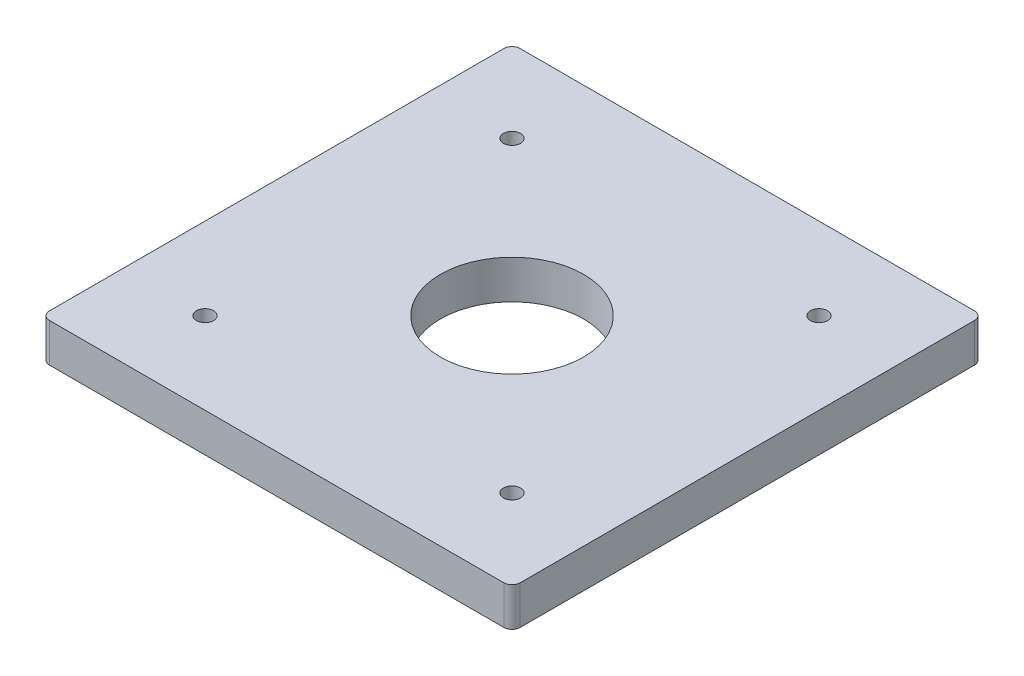
ISO-10303-21;
HEADER;
FILE_DESCRIPTION(('STEP AP214'),'2;1');
FILE_NAME('part.step','',(''),(''),'','','');
FILE_SCHEMA(('AUTOMOTIVE_DESIGN { 1 0 10303 214 1 1 1 1 }'));
ENDSEC;
DATA;
#1=APPLICATION_CONTEXT('core data for automotive mechanical design processes');
#2=APPLICATION_PROTOCOL_DEFINITION('international standard','automotive_design',2000,#1);
#3=PRODUCT_CONTEXT('',#1,'mechanical');
#4=PRODUCT('Part','Part','',(#3));
#5=PRODUCT_RELATED_PRODUCT_CATEGORY('part','',(#4));
#6=PRODUCT_DEFINITION_FORMATION('','',#4);
#7=PRODUCT_DEFINITION_CONTEXT('part definition',#1,'design');
#8=PRODUCT_DEFINITION('design','',#6,#7);
#9=PRODUCT_DEFINITION_SHAPE('','',#8);
#10=(LENGTH_UNIT() NAMED_UNIT(*) SI_UNIT(.MILLI.,.METRE.));
#11=(NAMED_UNIT(*) PLANE_ANGLE_UNIT() SI_UNIT($,.RADIAN.));
#12=(NAMED_UNIT(*) SI_UNIT($,.STERADIAN.) SOLID_ANGLE_UNIT());
#13=UNCERTAINTY_MEASURE_WITH_UNIT(LENGTH_MEASURE(1.E-05),#10,'distance_accuracy_value','');
#14=(GEOMETRIC_REPRESENTATION_CONTEXT(3) GLOBAL_UNCERTAINTY_ASSIGNED_CONTEXT((#13)) GLOBAL_UNIT_ASSIGNED_CONTEXT((#10,
#11,#12)) REPRESENTATION_CONTEXT('',''));
#15=CARTESIAN_POINT('',(0.,0.,0.));
#16=DIRECTION('',(0.,0.,1.));
#17=DIRECTION('',(1.,0.,0.));
#18=AXIS2_PLACEMENT_3D('',#15,#16,#17);
#19=CARTESIAN_POINT('',(0.,0.,0.));
#20=DIRECTION('',(0.,1.,0.));
#21=DIRECTION('',(0.,0.,1.));
#22=AXIS2_PLACEMENT_3D('',#19,#20,#21);
#23=PLANE('',#22);
#24=CARTESIAN_POINT('',(-47.625,0.,47.6249999999999));
#25=DIRECTION('',(0.,1.,0.));
#26=DIRECTION('',(0.,0.,1.));
#27=AXIS2_PLACEMENT_3D('',#24,#25,#26);
#28=CIRCLE('',#27,2.667);
#29=CARTESIAN_POINT('',(-47.625,0.,50.2919999999999));
#30=VERTEX_POINT('',#29);
#31=EDGE_CURVE('E145',#30,#30,#28,.T.);
#32=ORIENTED_EDGE('',*,*,#31,.T.);
#33=EDGE_LOOP('',(#32));
#34=FACE_BOUND('',#33,.T.);
#35=CARTESIAN_POINT('',(47.6249999999999,0.,-47.6250000000001));
#36=DIRECTION('',(0.,1.,0.));
#37=DIRECTION('',(0.,0.,1.));
#38=AXIS2_PLACEMENT_3D('',#35,#36,#37);
#39=CIRCLE('',#38,2.667);
#40=CARTESIAN_POINT('',(47.6249999999999,0.,-44.9580000000001));
#41=VERTEX_POINT('',#40);
#42=EDGE_CURVE('E148',#41,#41,#39,.T.);
#43=ORIENTED_EDGE('',*,*,#42,.T.);
#44=EDGE_LOOP('',(#43));
#45=FACE_BOUND('',#44,.T.);
#46=CARTESIAN_POINT('',(0.,0.,0.));
#47=DIRECTION('',(0.,-1.,0.));
#48=DIRECTION('',(0.,0.,-1.));
#49=AXIS2_PLACEMENT_3D('',#46,#47,#48);
#50=CIRCLE('',#49,22.225);
#51=CARTESIAN_POINT('',(0.,0.,-22.225));
#52=VERTEX_POINT('',#51);
#53=EDGE_CURVE('E151',#52,#52,#50,.F.);
#54=ORIENTED_EDGE('',*,*,#53,.T.);
#55=EDGE_LOOP('',(#54));
#56=FACE_BOUND('',#55,.T.);
#57=CARTESIAN_POINT('',(-70.485,0.,-70.485));
#58=DIRECTION('',(0.,-1.,0.));
#59=DIRECTION('',(0.,0.,-1.));
#60=AXIS2_PLACEMENT_3D('',#57,#58,#59);
#61=CIRCLE('',#60,2.54);
#62=CARTESIAN_POINT('',(-70.485,0.,-73.025));
#63=VERTEX_POINT('',#62);
#64=CARTESIAN_POINT('',(-73.025,0.,-70.485));
#65=VERTEX_POINT('',#64);
#66=EDGE_CURVE('E86',#63,#65,#61,.F.);
#67=ORIENTED_EDGE('',*,*,#66,.F.);
#68=DIRECTION('',(1.,0.,0.));
#69=VECTOR('',#68,1.);
#70=CARTESIAN_POINT('',(73.025,0.,-73.025));
#71=LINE('',#70,#69);
#72=CARTESIAN_POINT('',(70.485,0.,-73.025));
#73=VERTEX_POINT('',#72);
#74=EDGE_CURVE('E78',#63,#73,#71,.T.);
#75=ORIENTED_EDGE('',*,*,#74,.T.);
#76=CARTESIAN_POINT('',(70.485,0.,-70.485));
#77=DIRECTION('',(0.,-1.,0.));
#78=DIRECTION('',(0.,0.,-1.));
#79=AXIS2_PLACEMENT_3D('',#76,#77,#78);
#80=CIRCLE('',#79,2.54);
#81=CARTESIAN_POINT('',(73.025,0.,-70.485));
#82=VERTEX_POINT('',#81);
#83=EDGE_CURVE('E155',#82,#73,#80,.F.);
#84=ORIENTED_EDGE('',*,*,#83,.F.);
#85=DIRECTION('',(0.,0.,1.));
#86=VECTOR('',#85,1.);
#87=CARTESIAN_POINT('',(73.025,0.,73.025));
#88=LINE('',#87,#86);
#89=CARTESIAN_POINT('',(73.025,0.,70.485));
#90=VERTEX_POINT('',#89);
#91=EDGE_CURVE('E113',#82,#90,#88,.T.);
#92=ORIENTED_EDGE('',*,*,#91,.T.);
#93=CARTESIAN_POINT('',(70.485,0.,70.485));
#94=DIRECTION('',(0.,-1.,0.));
#95=DIRECTION('',(0.,0.,-1.));
#96=AXIS2_PLACEMENT_3D('',#93,#94,#95);
#97=CIRCLE('',#96,2.54);
#98=CARTESIAN_POINT('',(70.485,0.,73.025));
#99=VERTEX_POINT('',#98);
#100=EDGE_CURVE('E158',#99,#90,#97,.F.);
#101=ORIENTED_EDGE('',*,*,#100,.F.);
#102=DIRECTION('',(-1.,0.,0.));
#103=VECTOR('',#102,1.);
#104=CARTESIAN_POINT('',(73.025,0.,73.025));
#105=LINE('',#104,#103);
#106=CARTESIAN_POINT('',(-70.485,0.,73.025));
#107=VERTEX_POINT('',#106);
#108=EDGE_CURVE('E117',#99,#107,#105,.T.);
#109=ORIENTED_EDGE('',*,*,#108,.T.);
#110=CARTESIAN_POINT('',(-70.485,0.,70.485));
#111=DIRECTION('',(0.,-1.,0.));
#112=DIRECTION('',(0.,0.,-1.));
#113=AXIS2_PLACEMENT_3D('',#110,#111,#112);
#114=CIRCLE('',#113,2.54);
#115=CARTESIAN_POINT('',(-73.025,0.,70.485));
#116=VERTEX_POINT('',#115);
#117=EDGE_CURVE('E89',#116,#107,#114,.F.);
#118=ORIENTED_EDGE('',*,*,#117,.F.);
#119=DIRECTION('',(0.,0.,-1.));
#120=VECTOR('',#119,1.);
#121=CARTESIAN_POINT('',(-73.025,0.,73.025));
#122=LINE('',#121,#120);
#123=EDGE_CURVE('E83',#116,#65,#122,.T.);
#124=ORIENTED_EDGE('',*,*,#123,.T.);
#125=EDGE_LOOP('',(#67,#75,#84,#92,#101,#109,#118,#124));
#126=FACE_BOUND('',#125,.T.);
#127=CARTESIAN_POINT('',(-47.6250000000001,0.,-47.6250000000001));
#128=DIRECTION('',(0.,1.,0.));
#129=DIRECTION('',(0.,0.,1.));
#130=AXIS2_PLACEMENT_3D('',#127,#128,#129);
#131=CIRCLE('',#130,2.667);
#132=CARTESIAN_POINT('',(-47.6250000000001,0.,-44.9580000000001));
#133=VERTEX_POINT('',#132);
#134=EDGE_CURVE('E112',#133,#133,#131,.T.);
#135=ORIENTED_EDGE('',*,*,#134,.T.);
#136=EDGE_LOOP('',(#135));
#137=FACE_BOUND('',#136,.T.);
#138=CARTESIAN_POINT('',(47.625,0.,47.6249999999999));
#139=DIRECTION('',(0.,1.,0.));
#140=DIRECTION('',(0.,0.,1.));
#141=AXIS2_PLACEMENT_3D('',#138,#139,#140);
#142=CIRCLE('',#141,2.667);
#143=CARTESIAN_POINT('',(47.625,0.,50.2919999999999));
#144=VERTEX_POINT('',#143);
#145=EDGE_CURVE('E20',#144,#144,#142,.T.);
#146=ORIENTED_EDGE('',*,*,#145,.T.);
#147=EDGE_LOOP('',(#146));
#148=FACE_BOUND('',#147,.T.);
#149=ADVANCED_FACE('F17',(#34,#45,#56,#126,#137,#148),#23,.F.);
#150=CARTESIAN_POINT('',(47.625,0.,47.6249999999999));
#151=DIRECTION('',(0.,1.,0.));
#152=DIRECTION('',(0.,0.,1.));
#153=AXIS2_PLACEMENT_3D('',#150,#151,#152);
#154=CYLINDRICAL_SURFACE('',#153,2.667);
#155=ORIENTED_EDGE('',*,*,#145,.F.);
#156=EDGE_LOOP('',(#155));
#157=FACE_BOUND('',#156,.T.);
#158=CARTESIAN_POINT('',(47.625,12.,47.6249999999999));
#159=DIRECTION('',(0.,1.,0.));
#160=DIRECTION('',(0.,0.,1.));
#161=AXIS2_PLACEMENT_3D('',#158,#159,#160);
#162=CIRCLE('',#161,2.667);
#163=CARTESIAN_POINT('',(47.625,12.,50.2919999999999));
#164=VERTEX_POINT('',#163);
#165=EDGE_CURVE('E142',#164,#164,#162,.F.);
#166=ORIENTED_EDGE('',*,*,#165,.F.);
#167=EDGE_LOOP('',(#166));
#168=FACE_BOUND('',#167,.T.);
#169=ADVANCED_FACE('F167',(#157,#168),#154,.F.);
#170=CARTESIAN_POINT('',(-47.6250000000001,0.,-47.6250000000001));
#171=DIRECTION('',(0.,1.,0.));
#172=DIRECTION('',(0.,0.,1.));
#173=AXIS2_PLACEMENT_3D('',#170,#171,#172);
#174=CYLINDRICAL_SURFACE('',#173,2.667);
#175=ORIENTED_EDGE('',*,*,#134,.F.);
#176=EDGE_LOOP('',(#175));
#177=FACE_BOUND('',#176,.T.);
#178=CARTESIAN_POINT('',(-47.6250000000001,12.,-47.6250000000001));
#179=DIRECTION('',(0.,1.,0.));
#180=DIRECTION('',(0.,0.,1.));
#181=AXIS2_PLACEMENT_3D('',#178,#179,#180);
#182=CIRCLE('',#181,2.667);
#183=CARTESIAN_POINT('',(-47.6250000000001,12.,-44.9580000000001));
#184=VERTEX_POINT('',#183);
#185=EDGE_CURVE('E139',#184,#184,#182,.F.);
#186=ORIENTED_EDGE('',*,*,#185,.F.);
#187=EDGE_LOOP('',(#186));
#188=FACE_BOUND('',#187,.T.);
#189=ADVANCED_FACE('F170',(#177,#188),#174,.F.);
#190=CARTESIAN_POINT('',(73.025,12.,-73.025));
#191=DIRECTION('',(0.,0.,1.));
#192=DIRECTION('',(1.,0.,0.));
#193=AXIS2_PLACEMENT_3D('',#190,#191,#192);
#194=PLANE('',#193);
#195=DIRECTION('',(0.,-1.,0.));
#196=VECTOR('',#195,1.);
#197=CARTESIAN_POINT('',(-70.485,12.,-73.025));
#198=LINE('',#197,#196);
#199=CARTESIAN_POINT('',(-70.485,12.,-73.025));
#200=VERTEX_POINT('',#199);
#201=EDGE_CURVE('E99',#200,#63,#198,.T.);
#202=ORIENTED_EDGE('',*,*,#201,.F.);
#203=DIRECTION('',(1.,0.,0.));
#204=VECTOR('',#203,1.);
#205=CARTESIAN_POINT('',(0.,12.,-73.025));
#206=LINE('',#205,#204);
#207=CARTESIAN_POINT('',(70.485,12.,-73.025));
#208=VERTEX_POINT('',#207);
#209=EDGE_CURVE('E138',#208,#200,#206,.F.);
#210=ORIENTED_EDGE('',*,*,#209,.F.);
#211=DIRECTION('',(0.,-1.,0.));
#212=VECTOR('',#211,1.);
#213=CARTESIAN_POINT('',(70.485,12.,-73.025));
#214=LINE('',#213,#212);
#215=EDGE_CURVE('E154',#73,#208,#214,.F.);
#216=ORIENTED_EDGE('',*,*,#215,.F.);
#217=ORIENTED_EDGE('',*,*,#74,.F.);
#218=EDGE_LOOP('',(#202,#210,#216,#217));
#219=FACE_BOUND('',#218,.T.);
#220=ADVANCED_FACE('F217',(#219),#194,.F.);
#221=CARTESIAN_POINT('',(-70.485,12.,-70.485));
#222=DIRECTION('',(0.,-1.,0.));
#223=DIRECTION('',(0.,0.,-1.));
#224=AXIS2_PLACEMENT_3D('',#221,#222,#223);
#225=CYLINDRICAL_SURFACE('',#224,2.54);
#226=ORIENTED_EDGE('',*,*,#66,.T.);
#227=DIRECTION('',(0.,1.,0.));
#228=VECTOR('',#227,1.);
#229=CARTESIAN_POINT('',(-73.025,12.,-70.485));
#230=LINE('',#229,#228);
#231=CARTESIAN_POINT('',(-73.025,12.,-70.485));
#232=VERTEX_POINT('',#231);
#233=EDGE_CURVE('E93',#65,#232,#230,.T.);
#234=ORIENTED_EDGE('',*,*,#233,.T.);
#235=CARTESIAN_POINT('',(-70.485,12.,-70.485));
#236=DIRECTION('',(0.,-1.,0.));
#237=DIRECTION('',(0.,0.,-1.));
#238=AXIS2_PLACEMENT_3D('',#235,#236,#237);
#239=CIRCLE('',#238,2.54);
#240=EDGE_CURVE('E136',#200,#232,#239,.F.);
#241=ORIENTED_EDGE('',*,*,#240,.F.);
#242=ORIENTED_EDGE('',*,*,#201,.T.);
#243=EDGE_LOOP('',(#226,#234,#241,#242));
#244=FACE_BOUND('',#243,.T.);
#245=ADVANCED_FACE('F96',(#244),#225,.T.);
#246=CARTESIAN_POINT('',(-73.025,12.,73.025));
#247=DIRECTION('',(1.,0.,0.));
#248=DIRECTION('',(0.,0.,-1.));
#249=AXIS2_PLACEMENT_3D('',#246,#247,#248);
#250=PLANE('',#249);
#251=ORIENTED_EDGE('',*,*,#233,.F.);
#252=ORIENTED_EDGE('',*,*,#123,.F.);
#253=DIRECTION('',(0.,-1.,0.));
#254=VECTOR('',#253,1.);
#255=CARTESIAN_POINT('',(-73.025,12.,70.485));
#256=LINE('',#255,#254);
#257=CARTESIAN_POINT('',(-73.025,12.,70.485));
#258=VERTEX_POINT('',#257);
#259=EDGE_CURVE('E105',#258,#116,#256,.T.);
#260=ORIENTED_EDGE('',*,*,#259,.F.);
#261=DIRECTION('',(0.,0.,1.));
#262=VECTOR('',#261,1.);
#263=CARTESIAN_POINT('',(-73.025,12.,0.));
#264=LINE('',#263,#262);
#265=EDGE_CURVE('E103',#232,#258,#264,.T.);
#266=ORIENTED_EDGE('',*,*,#265,.F.);
#267=EDGE_LOOP('',(#251,#252,#260,#266));
#268=FACE_BOUND('',#267,.T.);
#269=ADVANCED_FACE('F101',(#268),#250,.F.);
#270=CARTESIAN_POINT('',(-70.485,12.,70.485));
#271=DIRECTION('',(0.,-1.,0.));
#272=DIRECTION('',(0.,0.,-1.));
#273=AXIS2_PLACEMENT_3D('',#270,#271,#272);
#274=CYLINDRICAL_SURFACE('',#273,2.54);
#275=ORIENTED_EDGE('',*,*,#117,.T.);
#276=DIRECTION('',(0.,1.,0.));
#277=VECTOR('',#276,1.);
#278=CARTESIAN_POINT('',(-70.485,12.,73.025));
#279=LINE('',#278,#277);
#280=CARTESIAN_POINT('',(-70.485,12.,73.025));
#281=VERTEX_POINT('',#280);
#282=EDGE_CURVE('E118',#107,#281,#279,.T.);
#283=ORIENTED_EDGE('',*,*,#282,.T.);
#284=CARTESIAN_POINT('',(-70.485,12.,70.485));
#285=DIRECTION('',(0.,-1.,0.));
#286=DIRECTION('',(0.,0.,-1.));
#287=AXIS2_PLACEMENT_3D('',#284,#285,#286);
#288=CIRCLE('',#287,2.54);
#289=EDGE_CURVE('E133',#258,#281,#288,.F.);
#290=ORIENTED_EDGE('',*,*,#289,.F.);
#291=ORIENTED_EDGE('',*,*,#259,.T.);
#292=EDGE_LOOP('',(#275,#283,#290,#291));
#293=FACE_BOUND('',#292,.T.);
#294=ADVANCED_FACE('F208',(#293),#274,.T.);
#295=CARTESIAN_POINT('',(73.025,12.,73.025));
#296=DIRECTION('',(0.,0.,-1.));
#297=DIRECTION('',(-1.,0.,0.));
#298=AXIS2_PLACEMENT_3D('',#295,#296,#297);
#299=PLANE('',#298);
#300=ORIENTED_EDGE('',*,*,#282,.F.);
#301=ORIENTED_EDGE('',*,*,#108,.F.);
#302=DIRECTION('',(0.,-1.,0.));
#303=VECTOR('',#302,1.);
#304=CARTESIAN_POINT('',(70.485,12.,73.025));
#305=LINE('',#304,#303);
#306=CARTESIAN_POINT('',(70.485,12.,73.025));
#307=VERTEX_POINT('',#306);
#308=EDGE_CURVE('E160',#307,#99,#305,.T.);
#309=ORIENTED_EDGE('',*,*,#308,.F.);
#310=DIRECTION('',(1.,0.,0.));
#311=VECTOR('',#310,1.);
#312=CARTESIAN_POINT('',(0.,12.,73.025));
#313=LINE('',#312,#311);
#314=EDGE_CURVE('E132',#281,#307,#313,.T.);
#315=ORIENTED_EDGE('',*,*,#314,.F.);
#316=EDGE_LOOP('',(#300,#301,#309,#315));
#317=FACE_BOUND('',#316,.T.);
#318=ADVANCED_FACE('F204',(#317),#299,.F.);
#319=CARTESIAN_POINT('',(70.485,12.,70.485));
#320=DIRECTION('',(0.,-1.,0.));
#321=DIRECTION('',(0.,0.,-1.));
#322=AXIS2_PLACEMENT_3D('',#319,#320,#321);
#323=CYLINDRICAL_SURFACE('',#322,2.54);
#324=ORIENTED_EDGE('',*,*,#100,.T.);
#325=DIRECTION('',(0.,1.,0.));
#326=VECTOR('',#325,1.);
#327=CARTESIAN_POINT('',(73.025,12.,70.485));
#328=LINE('',#327,#326);
#329=CARTESIAN_POINT('',(73.025,12.,70.485));
#330=VERTEX_POINT('',#329);
#331=EDGE_CURVE('E116',#90,#330,#328,.T.);
#332=ORIENTED_EDGE('',*,*,#331,.T.);
#333=CARTESIAN_POINT('',(70.485,12.,70.485));
#334=DIRECTION('',(0.,-1.,0.));
#335=DIRECTION('',(0.,0.,-1.));
#336=AXIS2_PLACEMENT_3D('',#333,#334,#335);
#337=CIRCLE('',#336,2.54);
#338=EDGE_CURVE('E129',#307,#330,#337,.F.);
#339=ORIENTED_EDGE('',*,*,#338,.F.);
#340=ORIENTED_EDGE('',*,*,#308,.T.);
#341=EDGE_LOOP('',(#324,#332,#339,#340));
#342=FACE_BOUND('',#341,.T.);
#343=ADVANCED_FACE('F201',(#342),#323,.T.);
#344=CARTESIAN_POINT('',(73.025,12.,73.025));
#345=DIRECTION('',(-1.,0.,0.));
#346=DIRECTION('',(0.,0.,1.));
#347=AXIS2_PLACEMENT_3D('',#344,#345,#346);
#348=PLANE('',#347);
#349=DIRECTION('',(0.,-1.,0.));
#350=VECTOR('',#349,1.);
#351=CARTESIAN_POINT('',(73.025,12.,-70.485));
#352=LINE('',#351,#350);
#353=CARTESIAN_POINT('',(73.025,12.,-70.485));
#354=VERTEX_POINT('',#353);
#355=EDGE_CURVE('E35',#354,#82,#352,.T.);
#356=ORIENTED_EDGE('',*,*,#355,.F.);
#357=DIRECTION('',(0.,0.,1.));
#358=VECTOR('',#357,1.);
#359=CARTESIAN_POINT('',(73.025,12.,0.));
#360=LINE('',#359,#358);
#361=EDGE_CURVE('E128',#330,#354,#360,.F.);
#362=ORIENTED_EDGE('',*,*,#361,.F.);
#363=ORIENTED_EDGE('',*,*,#331,.F.);
#364=ORIENTED_EDGE('',*,*,#91,.F.);
#365=EDGE_LOOP('',(#356,#362,#363,#364));
#366=FACE_BOUND('',#365,.T.);
#367=ADVANCED_FACE('F197',(#366),#348,.F.);
#368=CARTESIAN_POINT('',(70.485,12.,-70.485));
#369=DIRECTION('',(0.,-1.,0.));
#370=DIRECTION('',(0.,0.,-1.));
#371=AXIS2_PLACEMENT_3D('',#368,#369,#370);
#372=CYLINDRICAL_SURFACE('',#371,2.54);
#373=ORIENTED_EDGE('',*,*,#83,.T.);
#374=ORIENTED_EDGE('',*,*,#215,.T.);
#375=CARTESIAN_POINT('',(70.485,12.,-70.485));
#376=DIRECTION('',(0.,-1.,0.));
#377=DIRECTION('',(0.,0.,-1.));
#378=AXIS2_PLACEMENT_3D('',#375,#376,#377);
#379=CIRCLE('',#378,2.54);
#380=EDGE_CURVE('E125',#354,#208,#379,.F.);
#381=ORIENTED_EDGE('',*,*,#380,.F.);
#382=ORIENTED_EDGE('',*,*,#355,.T.);
#383=EDGE_LOOP('',(#373,#374,#381,#382));
#384=FACE_BOUND('',#383,.T.);
#385=ADVANCED_FACE('F193',(#384),#372,.T.);
#386=CARTESIAN_POINT('',(0.,12.,0.));
#387=DIRECTION('',(0.,-1.,0.));
#388=DIRECTION('',(0.,0.,-1.));
#389=AXIS2_PLACEMENT_3D('',#386,#387,#388);
#390=CYLINDRICAL_SURFACE('',#389,22.225);
#391=CARTESIAN_POINT('',(0.,12.,0.));
#392=DIRECTION('',(0.,-1.,0.));
#393=DIRECTION('',(0.,0.,-1.));
#394=AXIS2_PLACEMENT_3D('',#391,#392,#393);
#395=CIRCLE('',#394,22.225);
#396=CARTESIAN_POINT('',(0.,12.,-22.225));
#397=VERTEX_POINT('',#396);
#398=EDGE_CURVE('E122',#397,#397,#395,.T.);
#399=ORIENTED_EDGE('',*,*,#398,.F.);
#400=EDGE_LOOP('',(#399));
#401=FACE_BOUND('',#400,.T.);
#402=ORIENTED_EDGE('',*,*,#53,.F.);
#403=EDGE_LOOP('',(#402));
#404=FACE_BOUND('',#403,.T.);
#405=ADVANCED_FACE('F189',(#401,#404),#390,.F.);
#406=CARTESIAN_POINT('',(47.6249999999999,0.,-47.6250000000001));
#407=DIRECTION('',(0.,1.,0.));
#408=DIRECTION('',(0.,0.,1.));
#409=AXIS2_PLACEMENT_3D('',#406,#407,#408);
#410=CYLINDRICAL_SURFACE('',#409,2.667);
#411=ORIENTED_EDGE('',*,*,#42,.F.);
#412=EDGE_LOOP('',(#411));
#413=FACE_BOUND('',#412,.T.);
#414=CARTESIAN_POINT('',(47.6249999999999,12.,-47.6250000000001));
#415=DIRECTION('',(0.,1.,0.));
#416=DIRECTION('',(0.,0.,1.));
#417=AXIS2_PLACEMENT_3D('',#414,#415,#416);
#418=CIRCLE('',#417,2.667);
#419=CARTESIAN_POINT('',(47.6249999999999,12.,-44.9580000000001));
#420=VERTEX_POINT('',#419);
#421=EDGE_CURVE('E26',#420,#420,#418,.F.);
#422=ORIENTED_EDGE('',*,*,#421,.F.);
#423=EDGE_LOOP('',(#422));
#424=FACE_BOUND('',#423,.T.);
#425=ADVANCED_FACE('F182',(#413,#424),#410,.F.);
#426=CARTESIAN_POINT('',(-47.625,0.,47.6249999999999));
#427=DIRECTION('',(0.,1.,0.));
#428=DIRECTION('',(0.,0.,1.));
#429=AXIS2_PLACEMENT_3D('',#426,#427,#428);
#430=CYLINDRICAL_SURFACE('',#429,2.667);
#431=ORIENTED_EDGE('',*,*,#31,.F.);
#432=EDGE_LOOP('',(#431));
#433=FACE_BOUND('',#432,.T.);
#434=CARTESIAN_POINT('',(-47.625,12.,47.6249999999999));
#435=DIRECTION('',(0.,1.,0.));
#436=DIRECTION('',(0.,0.,1.));
#437=AXIS2_PLACEMENT_3D('',#434,#435,#436);
#438=CIRCLE('',#437,2.667);
#439=CARTESIAN_POINT('',(-47.625,12.,50.2919999999999));
#440=VERTEX_POINT('',#439);
#441=EDGE_CURVE('E11',#440,#440,#438,.F.);
#442=ORIENTED_EDGE('',*,*,#441,.F.);
#443=EDGE_LOOP('',(#442));
#444=FACE_BOUND('',#443,.T.);
#445=ADVANCED_FACE('F175',(#433,#444),#430,.F.);
#446=CARTESIAN_POINT('',(0.,12.,0.));
#447=DIRECTION('',(0.,1.,0.));
#448=DIRECTION('',(0.,0.,1.));
#449=AXIS2_PLACEMENT_3D('',#446,#447,#448);
#450=PLANE('',#449);
#451=ORIENTED_EDGE('',*,*,#441,.T.);
#452=EDGE_LOOP('',(#451));
#453=FACE_BOUND('',#452,.T.);
#454=ORIENTED_EDGE('',*,*,#421,.T.);
#455=EDGE_LOOP('',(#454));
#456=FACE_BOUND('',#455,.T.);
#457=ORIENTED_EDGE('',*,*,#398,.T.);
#458=EDGE_LOOP('',(#457));
#459=FACE_BOUND('',#458,.T.);
#460=ORIENTED_EDGE('',*,*,#361,.T.);
#461=ORIENTED_EDGE('',*,*,#380,.T.);
#462=ORIENTED_EDGE('',*,*,#209,.T.);
#463=ORIENTED_EDGE('',*,*,#240,.T.);
#464=ORIENTED_EDGE('',*,*,#265,.T.);
#465=ORIENTED_EDGE('',*,*,#289,.T.);
#466=ORIENTED_EDGE('',*,*,#314,.T.);
#467=ORIENTED_EDGE('',*,*,#338,.T.);
#468=EDGE_LOOP('',(#460,#461,#462,#463,#464,#465,#466,#467));
#469=FACE_BOUND('',#468,.T.);
#470=ORIENTED_EDGE('',*,*,#185,.T.);
#471=EDGE_LOOP('',(#470));
#472=FACE_BOUND('',#471,.T.);
#473=ORIENTED_EDGE('',*,*,#165,.T.);
#474=EDGE_LOOP('',(#473));
#475=FACE_BOUND('',#474,.T.);
#476=ADVANCED_FACE('F173',(#453,#456,#459,#469,#472,#475),#450,.T.);
#477=CLOSED_SHELL('',(#149,#169,#189,#220,#245,#269,#294,#318,#343,#367,#385,#405,#425,#445,#476));
#478=MANIFOLD_SOLID_BREP('B1',#477);
#479=ADVANCED_BREP_SHAPE_REPRESENTATION('',(#18,#478),#14);
#480=SHAPE_DEFINITION_REPRESENTATION(#9,#479);
ENDSEC;
END-ISO-10303-21;
